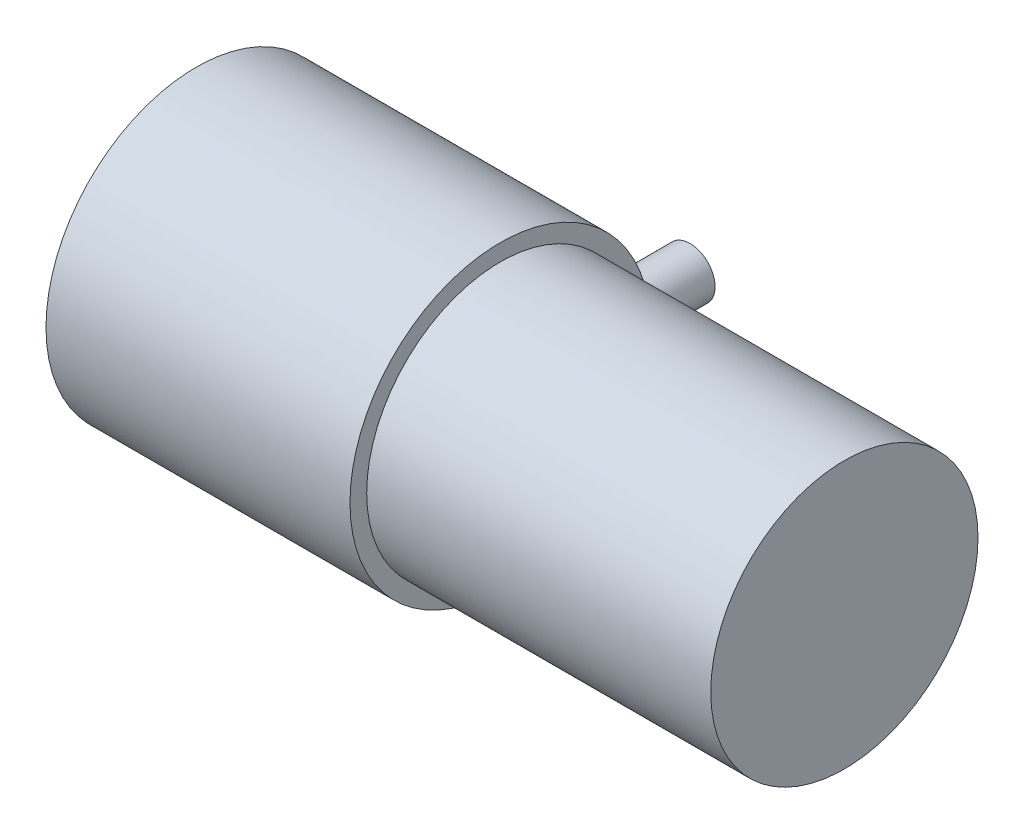
ISO-10303-21;
HEADER;
FILE_DESCRIPTION(('STEP AP214'),'2;1');
FILE_NAME('part.step','',(''),(''),'','','');
FILE_SCHEMA(('AUTOMOTIVE_DESIGN { 1 0 10303 214 1 1 1 1 }'));
ENDSEC;
DATA;
#1=APPLICATION_CONTEXT('core data for automotive mechanical design processes');
#2=APPLICATION_PROTOCOL_DEFINITION('international standard','automotive_design',2000,#1);
#3=PRODUCT_CONTEXT('',#1,'mechanical');
#4=PRODUCT('Part','Part','',(#3));
#5=PRODUCT_RELATED_PRODUCT_CATEGORY('part','',(#4));
#6=PRODUCT_DEFINITION_FORMATION('','',#4);
#7=PRODUCT_DEFINITION_CONTEXT('part definition',#1,'design');
#8=PRODUCT_DEFINITION('design','',#6,#7);
#9=PRODUCT_DEFINITION_SHAPE('','',#8);
#10=(LENGTH_UNIT() NAMED_UNIT(*) SI_UNIT(.MILLI.,.METRE.));
#11=(NAMED_UNIT(*) PLANE_ANGLE_UNIT() SI_UNIT($,.RADIAN.));
#12=(NAMED_UNIT(*) SI_UNIT($,.STERADIAN.) SOLID_ANGLE_UNIT());
#13=UNCERTAINTY_MEASURE_WITH_UNIT(LENGTH_MEASURE(1.E-05),#10,'distance_accuracy_value','');
#14=(GEOMETRIC_REPRESENTATION_CONTEXT(3) GLOBAL_UNCERTAINTY_ASSIGNED_CONTEXT((#13)) GLOBAL_UNIT_ASSIGNED_CONTEXT((#10,
#11,#12)) REPRESENTATION_CONTEXT('',''));
#15=CARTESIAN_POINT('',(0.,0.,0.));
#16=DIRECTION('',(0.,0.,1.));
#17=DIRECTION('',(1.,0.,0.));
#18=AXIS2_PLACEMENT_3D('',#15,#16,#17);
#19=CARTESIAN_POINT('',(24.6389245995307,0.,-19.7));
#20=DIRECTION('',(0.,0.,1.));
#21=DIRECTION('',(1.,0.,0.));
#22=AXIS2_PLACEMENT_3D('',#19,#20,#21);
#23=CYLINDRICAL_SURFACE('',#22,2.25);
#24=CARTESIAN_POINT('',(24.6389245995307,0.,-19.7));
#25=DIRECTION('',(0.,0.,-1.));
#26=DIRECTION('',(-1.,0.,0.));
#27=AXIS2_PLACEMENT_3D('',#24,#25,#26);
#28=CIRCLE('',#27,2.25);
#29=CARTESIAN_POINT('',(22.3889245995307,0.,-19.7));
#30=VERTEX_POINT('',#29);
#31=EDGE_CURVE('E11',#30,#30,#28,.T.);
#32=ORIENTED_EDGE('',*,*,#31,.F.);
#33=EDGE_LOOP('',(#32));
#34=FACE_BOUND('',#33,.T.);
#35=CARTESIAN_POINT('',(24.6389245995307,0.,-13.5));
#36=DIRECTION('',(0.,0.,-1.));
#37=DIRECTION('',(-1.,0.,0.));
#38=AXIS2_PLACEMENT_3D('',#35,#36,#37);
#39=CIRCLE('',#38,2.25);
#40=CARTESIAN_POINT('',(22.3889245995307,0.,-13.5));
#41=VERTEX_POINT('',#40);
#42=EDGE_CURVE('E48',#41,#41,#39,.T.);
#43=ORIENTED_EDGE('',*,*,#42,.T.);
#44=EDGE_LOOP('',(#43));
#45=FACE_BOUND('',#44,.T.);
#46=ADVANCED_FACE('F45',(#34,#45),#23,.T.);
#47=CARTESIAN_POINT('',(24.6389245995307,0.,-19.7));
#48=DIRECTION('',(0.,0.,-1.));
#49=DIRECTION('',(-1.,0.,0.));
#50=AXIS2_PLACEMENT_3D('',#47,#48,#49);
#51=PLANE('',#50);
#52=ORIENTED_EDGE('',*,*,#31,.T.);
#53=EDGE_LOOP('',(#52));
#54=FACE_BOUND('',#53,.T.);
#55=ADVANCED_FACE('F60',(#54),#51,.T.);
#56=CARTESIAN_POINT('',(24.6389245995307,0.,-13.5));
#57=DIRECTION('',(0.,0.,-1.));
#58=DIRECTION('',(-1.,0.,0.));
#59=AXIS2_PLACEMENT_3D('',#56,#57,#58);
#60=PLANE('',#59);
#61=ORIENTED_EDGE('',*,*,#42,.F.);
#62=EDGE_LOOP('',(#61));
#63=FACE_BOUND('',#62,.T.);
#64=ADVANCED_FACE('F58',(#63),#60,.F.);
#65=CLOSED_SHELL('',(#46,#55,#64));
#66=MANIFOLD_SOLID_BREP('B2',#65);
#67=CARTESIAN_POINT('',(27.3,0.,0.));
#68=DIRECTION('',(-1.,0.,0.));
#69=DIRECTION('',(0.,0.,1.));
#70=AXIS2_PLACEMENT_3D('',#67,#68,#69);
#71=CYLINDRICAL_SURFACE('',#70,13.5);
#72=CARTESIAN_POINT('',(27.3,0.,0.));
#73=DIRECTION('',(1.,0.,0.));
#74=DIRECTION('',(0.,0.,-1.));
#75=AXIS2_PLACEMENT_3D('',#72,#73,#74);
#76=CIRCLE('',#75,13.5);
#77=CARTESIAN_POINT('',(27.3,0.,-13.5));
#78=VERTEX_POINT('',#77);
#79=EDGE_CURVE('E100',#78,#78,#76,.T.);
#80=ORIENTED_EDGE('',*,*,#79,.F.);
#81=EDGE_LOOP('',(#80));
#82=FACE_BOUND('',#81,.T.);
#83=CARTESIAN_POINT('',(0.,0.,0.));
#84=DIRECTION('',(1.,0.,0.));
#85=DIRECTION('',(0.,0.,-1.));
#86=AXIS2_PLACEMENT_3D('',#83,#84,#85);
#87=CIRCLE('',#86,13.5);
#88=CARTESIAN_POINT('',(0.,0.,-13.5));
#89=VERTEX_POINT('',#88);
#90=EDGE_CURVE('E89',#89,#89,#87,.T.);
#91=ORIENTED_EDGE('',*,*,#90,.T.);
#92=EDGE_LOOP('',(#91));
#93=FACE_BOUND('',#92,.T.);
#94=ADVANCED_FACE('F86',(#82,#93),#71,.T.);
#95=CARTESIAN_POINT('',(27.3,0.,0.));
#96=DIRECTION('',(1.,0.,0.));
#97=DIRECTION('',(0.,0.,-1.));
#98=AXIS2_PLACEMENT_3D('',#95,#96,#97);
#99=PLANE('',#98);
#100=CARTESIAN_POINT('',(27.3,0.,0.));
#101=DIRECTION('',(1.,0.,0.));
#102=DIRECTION('',(0.,0.,-1.));
#103=AXIS2_PLACEMENT_3D('',#100,#101,#102);
#104=CIRCLE('',#103,12.);
#105=CARTESIAN_POINT('',(27.3,0.,-12.));
#106=VERTEX_POINT('',#105);
#107=EDGE_CURVE('E94',#106,#106,#104,.T.);
#108=ORIENTED_EDGE('',*,*,#107,.F.);
#109=EDGE_LOOP('',(#108));
#110=FACE_BOUND('',#109,.T.);
#111=ORIENTED_EDGE('',*,*,#79,.T.);
#112=EDGE_LOOP('',(#111));
#113=FACE_BOUND('',#112,.T.);
#114=ADVANCED_FACE('F120',(#110,#113),#99,.T.);
#115=CARTESIAN_POINT('',(0.,0.,0.));
#116=DIRECTION('',(1.,0.,0.));
#117=DIRECTION('',(0.,0.,-1.));
#118=AXIS2_PLACEMENT_3D('',#115,#116,#117);
#119=PLANE('',#118);
#120=CARTESIAN_POINT('',(0.,0.,0.));
#121=DIRECTION('',(-1.,0.,0.));
#122=DIRECTION('',(0.,0.,1.));
#123=AXIS2_PLACEMENT_3D('',#120,#121,#122);
#124=CIRCLE('',#123,2.05);
#125=CARTESIAN_POINT('',(0.,0.,2.05));
#126=VERTEX_POINT('',#125);
#127=EDGE_CURVE('E44',#126,#126,#124,.T.);
#128=ORIENTED_EDGE('',*,*,#127,.F.);
#129=EDGE_LOOP('',(#128));
#130=FACE_BOUND('',#129,.T.);
#131=ORIENTED_EDGE('',*,*,#90,.F.);
#132=EDGE_LOOP('',(#131));
#133=FACE_BOUND('',#132,.T.);
#134=ADVANCED_FACE('F117',(#130,#133),#119,.F.);
#135=CARTESIAN_POINT('',(58.2,0.,0.));
#136=DIRECTION('',(-1.,0.,0.));
#137=DIRECTION('',(0.,0.,1.));
#138=AXIS2_PLACEMENT_3D('',#135,#136,#137);
#139=CYLINDRICAL_SURFACE('',#138,12.);
#140=CARTESIAN_POINT('',(58.2,0.,0.));
#141=DIRECTION('',(1.,0.,0.));
#142=DIRECTION('',(0.,0.,-1.));
#143=AXIS2_PLACEMENT_3D('',#140,#141,#142);
#144=CIRCLE('',#143,12.);
#145=CARTESIAN_POINT('',(58.2,0.,-12.));
#146=VERTEX_POINT('',#145);
#147=EDGE_CURVE('E105',#146,#146,#144,.T.);
#148=ORIENTED_EDGE('',*,*,#147,.F.);
#149=EDGE_LOOP('',(#148));
#150=FACE_BOUND('',#149,.T.);
#151=ORIENTED_EDGE('',*,*,#107,.T.);
#152=EDGE_LOOP('',(#151));
#153=FACE_BOUND('',#152,.T.);
#154=ADVANCED_FACE('F119',(#150,#153),#139,.T.);
#155=CARTESIAN_POINT('',(58.2,0.,0.));
#156=DIRECTION('',(1.,0.,0.));
#157=DIRECTION('',(0.,0.,-1.));
#158=AXIS2_PLACEMENT_3D('',#155,#156,#157);
#159=PLANE('',#158);
#160=ORIENTED_EDGE('',*,*,#147,.T.);
#161=EDGE_LOOP('',(#160));
#162=FACE_BOUND('',#161,.T.);
#163=ADVANCED_FACE('F126',(#162),#159,.T.);
#164=CARTESIAN_POINT('',(-6.2,0.,0.));
#165=DIRECTION('',(1.,0.,0.));
#166=DIRECTION('',(0.,0.,-1.));
#167=AXIS2_PLACEMENT_3D('',#164,#165,#166);
#168=CYLINDRICAL_SURFACE('',#167,2.05);
#169=CARTESIAN_POINT('',(-6.2,0.,0.));
#170=DIRECTION('',(-1.,0.,0.));
#171=DIRECTION('',(0.,0.,1.));
#172=AXIS2_PLACEMENT_3D('',#169,#170,#171);
#173=CIRCLE('',#172,2.05);
#174=CARTESIAN_POINT('',(-6.2,0.,2.05));
#175=VERTEX_POINT('',#174);
#176=EDGE_CURVE('E104',#175,#175,#173,.T.);
#177=ORIENTED_EDGE('',*,*,#176,.F.);
#178=EDGE_LOOP('',(#177));
#179=FACE_BOUND('',#178,.T.);
#180=ORIENTED_EDGE('',*,*,#127,.T.);
#181=EDGE_LOOP('',(#180));
#182=FACE_BOUND('',#181,.T.);
#183=ADVANCED_FACE('F154',(#179,#182),#168,.T.);
#184=CARTESIAN_POINT('',(-6.2,0.,0.));
#185=DIRECTION('',(-1.,0.,0.));
#186=DIRECTION('',(0.,0.,1.));
#187=AXIS2_PLACEMENT_3D('',#184,#185,#186);
#188=PLANE('',#187);
#189=ORIENTED_EDGE('',*,*,#176,.T.);
#190=EDGE_LOOP('',(#189));
#191=FACE_BOUND('',#190,.T.);
#192=ADVANCED_FACE('F168',(#191),#188,.T.);
#193=CLOSED_SHELL('',(#94,#114,#134,#154,#163,#183,#192));
#194=MANIFOLD_SOLID_BREP('B6',#193);
#195=ADVANCED_BREP_SHAPE_REPRESENTATION('',(#18,#66,#194),#14);
#196=SHAPE_DEFINITION_REPRESENTATION(#9,#195);
ENDSEC;
END-ISO-10303-21;
